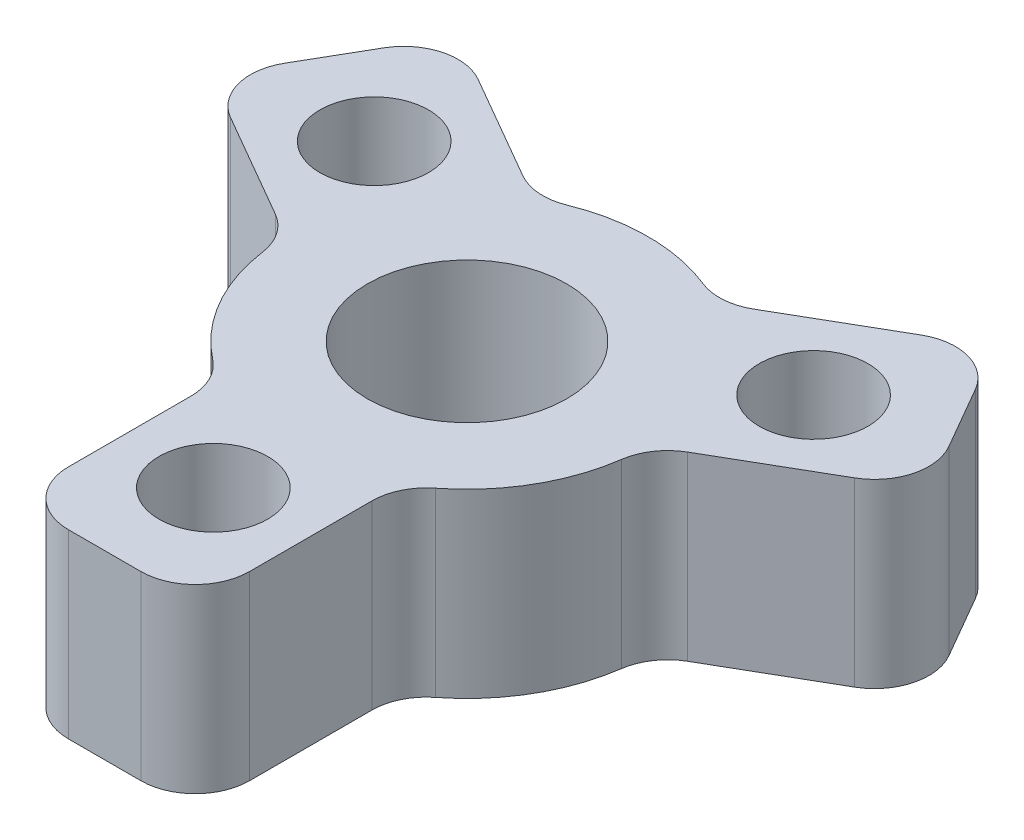
ISO-10303-21;
HEADER;
FILE_DESCRIPTION(('STEP AP214'),'2;1');
FILE_NAME('part.step','',(''),(''),'','','');
FILE_SCHEMA(('AUTOMOTIVE_DESIGN { 1 0 10303 214 1 1 1 1 }'));
ENDSEC;
DATA;
#1=APPLICATION_CONTEXT('core data for automotive mechanical design processes');
#2=APPLICATION_PROTOCOL_DEFINITION('international standard','automotive_design',2000,#1);
#3=PRODUCT_CONTEXT('',#1,'mechanical');
#4=PRODUCT('Part','Part','',(#3));
#5=PRODUCT_RELATED_PRODUCT_CATEGORY('part','',(#4));
#6=PRODUCT_DEFINITION_FORMATION('','',#4);
#7=PRODUCT_DEFINITION_CONTEXT('part definition',#1,'design');
#8=PRODUCT_DEFINITION('design','',#6,#7);
#9=PRODUCT_DEFINITION_SHAPE('','',#8);
#10=(LENGTH_UNIT() NAMED_UNIT(*) SI_UNIT(.MILLI.,.METRE.));
#11=(NAMED_UNIT(*) PLANE_ANGLE_UNIT() SI_UNIT($,.RADIAN.));
#12=(NAMED_UNIT(*) SI_UNIT($,.STERADIAN.) SOLID_ANGLE_UNIT());
#13=UNCERTAINTY_MEASURE_WITH_UNIT(LENGTH_MEASURE(1.E-05),#10,'distance_accuracy_value','');
#14=(GEOMETRIC_REPRESENTATION_CONTEXT(3) GLOBAL_UNCERTAINTY_ASSIGNED_CONTEXT((#13)) GLOBAL_UNIT_ASSIGNED_CONTEXT((#10,
#11,#12)) REPRESENTATION_CONTEXT('',''));
#15=CARTESIAN_POINT('',(0.,0.,0.));
#16=DIRECTION('',(0.,0.,1.));
#17=DIRECTION('',(1.,0.,0.));
#18=AXIS2_PLACEMENT_3D('',#15,#16,#17);
#19=CARTESIAN_POINT('',(0.,5.,0.));
#20=DIRECTION('',(0.,-1.,0.));
#21=DIRECTION('',(0.,0.,-1.));
#22=AXIS2_PLACEMENT_3D('',#19,#20,#21);
#23=CYLINDRICAL_SURFACE('',#22,5.);
#24=CARTESIAN_POINT('',(0.,0.,0.));
#25=DIRECTION('',(0.,1.,0.));
#26=DIRECTION('',(0.,0.,1.));
#27=AXIS2_PLACEMENT_3D('',#24,#25,#26);
#28=CIRCLE('',#27,5.);
#29=CARTESIAN_POINT('',(1.87466141332668,0.,-4.6352610050982));
#30=VERTEX_POINT('',#29);
#31=CARTESIAN_POINT('',(-1.87466141332675,0.,-4.63526100509818));
#32=VERTEX_POINT('',#31);
#33=EDGE_CURVE('E326',#30,#32,#28,.T.);
#34=ORIENTED_EDGE('',*,*,#33,.T.);
#35=DIRECTION('',(0.,-1.,0.));
#36=VECTOR('',#35,1.);
#37=CARTESIAN_POINT('',(-1.87466141332675,5.,-4.63526100509818));
#38=LINE('',#37,#36);
#39=CARTESIAN_POINT('',(-1.87466141332675,5.,-4.63526100509818));
#40=VERTEX_POINT('',#39);
#41=EDGE_CURVE('E315',#32,#40,#38,.F.);
#42=ORIENTED_EDGE('',*,*,#41,.T.);
#43=CARTESIAN_POINT('',(0.,5.,0.));
#44=DIRECTION('',(0.,1.,0.));
#45=DIRECTION('',(0.,0.,1.));
#46=AXIS2_PLACEMENT_3D('',#43,#44,#45);
#47=CIRCLE('',#46,5.);
#48=CARTESIAN_POINT('',(1.87466141332668,5.,-4.6352610050982));
#49=VERTEX_POINT('',#48);
#50=EDGE_CURVE('E343',#49,#40,#47,.T.);
#51=ORIENTED_EDGE('',*,*,#50,.F.);
#52=DIRECTION('',(0.,-1.,0.));
#53=VECTOR('',#52,1.);
#54=CARTESIAN_POINT('',(1.87466141332668,5.,-4.6352610050982));
#55=LINE('',#54,#53);
#56=EDGE_CURVE('E278',#49,#30,#55,.T.);
#57=ORIENTED_EDGE('',*,*,#56,.T.);
#58=EDGE_LOOP('',(#34,#42,#51,#57));
#59=FACE_BOUND('',#58,.T.);
#60=ADVANCED_FACE('F33',(#59),#23,.T.);
#61=CARTESIAN_POINT('',(3.07692307692308,0.,3.94113490998446));
#62=VERTEX_POINT('',#61);
#63=CARTESIAN_POINT('',(4.95158449024978,0.,0.694126095113712));
#64=VERTEX_POINT('',#63);
#65=EDGE_CURVE('E337',#62,#64,#28,.T.);
#66=ORIENTED_EDGE('',*,*,#65,.T.);
#67=DIRECTION('',(0.,-1.,0.));
#68=VECTOR('',#67,1.);
#69=CARTESIAN_POINT('',(4.95158449024978,5.,0.694126095113713));
#70=LINE('',#69,#68);
#71=CARTESIAN_POINT('',(4.95158449024978,5.,0.694126095113712));
#72=VERTEX_POINT('',#71);
#73=EDGE_CURVE('E280',#64,#72,#70,.F.);
#74=ORIENTED_EDGE('',*,*,#73,.T.);
#75=CARTESIAN_POINT('',(3.07692307692308,5.,3.94113490998446));
#76=VERTEX_POINT('',#75);
#77=EDGE_CURVE('E224',#76,#72,#47,.T.);
#78=ORIENTED_EDGE('',*,*,#77,.F.);
#79=DIRECTION('',(0.,-1.,0.));
#80=VECTOR('',#79,1.);
#81=CARTESIAN_POINT('',(3.07692307692308,5.,3.94113490998446));
#82=LINE('',#81,#80);
#83=EDGE_CURVE('E243',#76,#62,#82,.T.);
#84=ORIENTED_EDGE('',*,*,#83,.T.);
#85=EDGE_LOOP('',(#66,#74,#78,#84));
#86=FACE_BOUND('',#85,.T.);
#87=ADVANCED_FACE('F422',(#86),#23,.T.);
#88=CARTESIAN_POINT('',(-4.95158449024977,5.,0.69412609511378));
#89=VERTEX_POINT('',#88);
#90=CARTESIAN_POINT('',(-3.07692307692308,5.,3.94113490998446));
#91=VERTEX_POINT('',#90);
#92=EDGE_CURVE('E393',#89,#91,#47,.T.);
#93=ORIENTED_EDGE('',*,*,#92,.F.);
#94=DIRECTION('',(0.,-1.,0.));
#95=VECTOR('',#94,1.);
#96=CARTESIAN_POINT('',(-4.95158449024977,5.,0.69412609511378));
#97=LINE('',#96,#95);
#98=CARTESIAN_POINT('',(-4.95158449024977,0.,0.69412609511378));
#99=VERTEX_POINT('',#98);
#100=EDGE_CURVE('E313',#89,#99,#97,.T.);
#101=ORIENTED_EDGE('',*,*,#100,.T.);
#102=CARTESIAN_POINT('',(-3.07692307692308,0.,3.94113490998446));
#103=VERTEX_POINT('',#102);
#104=EDGE_CURVE('E338',#99,#103,#28,.T.);
#105=ORIENTED_EDGE('',*,*,#104,.T.);
#106=DIRECTION('',(0.,-1.,0.));
#107=VECTOR('',#106,1.);
#108=CARTESIAN_POINT('',(-3.07692307692308,5.,3.94113490998446));
#109=LINE('',#108,#107);
#110=EDGE_CURVE('E240',#103,#91,#109,.F.);
#111=ORIENTED_EDGE('',*,*,#110,.T.);
#112=EDGE_LOOP('',(#93,#101,#105,#111));
#113=FACE_BOUND('',#112,.T.);
#114=ADVANCED_FACE('F400',(#113),#23,.T.);
#115=CARTESIAN_POINT('',(0.,5.,0.));
#116=DIRECTION('',(0.,1.,0.));
#117=DIRECTION('',(0.,0.,1.));
#118=AXIS2_PLACEMENT_3D('',#115,#116,#117);
#119=PLANE('',#118);
#120=CARTESIAN_POINT('',(0.,5.,0.));
#121=DIRECTION('',(0.,1.,0.));
#122=DIRECTION('',(0.,0.,1.));
#123=AXIS2_PLACEMENT_3D('',#120,#121,#122);
#124=CIRCLE('',#123,2.75);
#125=CARTESIAN_POINT('',(0.,5.,2.75));
#126=VERTEX_POINT('',#125);
#127=EDGE_CURVE('E445',#126,#126,#124,.T.);
#128=ORIENTED_EDGE('',*,*,#127,.F.);
#129=EDGE_LOOP('',(#128));
#130=FACE_BOUND('',#129,.T.);
#131=CARTESIAN_POINT('',(6.06217782649105,5.,-3.50000000000003));
#132=DIRECTION('',(0.,1.,0.));
#133=DIRECTION('',(0.866025403784436,0.,-0.500000000000004));
#134=AXIS2_PLACEMENT_3D('',#131,#132,#133);
#135=CIRCLE('',#134,1.5);
#136=CARTESIAN_POINT('',(7.36121593216771,5.,-4.25000000000004));
#137=VERTEX_POINT('',#136);
#138=EDGE_CURVE('E449',#137,#137,#135,.T.);
#139=ORIENTED_EDGE('',*,*,#138,.F.);
#140=EDGE_LOOP('',(#139));
#141=FACE_BOUND('',#140,.T.);
#142=CARTESIAN_POINT('',(-6.0621778264911,5.,-3.49999999999994));
#143=DIRECTION('',(0.,1.,0.));
#144=DIRECTION('',(-0.866025403784443,0.,-0.499999999999992));
#145=AXIS2_PLACEMENT_3D('',#142,#143,#144);
#146=CIRCLE('',#145,1.5);
#147=CARTESIAN_POINT('',(-7.36121593216777,5.,-4.24999999999993));
#148=VERTEX_POINT('',#147);
#149=EDGE_CURVE('E452',#148,#148,#146,.T.);
#150=ORIENTED_EDGE('',*,*,#149,.F.);
#151=EDGE_LOOP('',(#150));
#152=FACE_BOUND('',#151,.T.);
#153=DIRECTION('',(-0.866025403784443,0.,-0.499999999999992));
#154=VECTOR('',#153,1.);
#155=CARTESIAN_POINT('',(-7.41025403784445,5.,-7.16506350946103));
#156=LINE('',#155,#154);
#157=CARTESIAN_POINT('',(-3.18705983732476,5.,-4.72680120095097));
#158=VERTEX_POINT('',#157);
#159=CARTESIAN_POINT('',(-6.11121593216779,5.,-6.41506350946104));
#160=VERTEX_POINT('',#159);
#161=EDGE_CURVE('E341',#158,#160,#156,.T.);
#162=ORIENTED_EDGE('',*,*,#161,.T.);
#163=CARTESIAN_POINT('',(-6.86121593216778,5.,-5.11602540378438));
#164=DIRECTION('',(0.,1.,0.));
#165=DIRECTION('',(0.,0.,1.));
#166=AXIS2_PLACEMENT_3D('',#163,#164,#165);
#167=CIRCLE('',#166,1.5);
#168=CARTESIAN_POINT('',(-8.16025403784444,5.,-5.86602540378436));
#169=VERTEX_POINT('',#168);
#170=EDGE_CURVE('E306',#160,#169,#167,.T.);
#171=ORIENTED_EDGE('',*,*,#170,.T.);
#172=DIRECTION('',(-0.499999999999992,0.,0.866025403784443));
#173=VECTOR('',#172,1.);
#174=CARTESIAN_POINT('',(-7.41025403784445,5.,-7.16506350946103));
#175=LINE('',#174,#173);
#176=CARTESIAN_POINT('',(-9.16025403784442,5.,-4.13397459621547));
#177=VERTEX_POINT('',#176);
#178=EDGE_CURVE('E353',#169,#177,#175,.T.);
#179=ORIENTED_EDGE('',*,*,#178,.T.);
#180=CARTESIAN_POINT('',(-7.86121593216776,5.,-3.38397459621549));
#181=DIRECTION('',(0.,1.,0.));
#182=DIRECTION('',(0.,0.,1.));
#183=AXIS2_PLACEMENT_3D('',#180,#181,#182);
#184=CIRCLE('',#183,1.5);
#185=CARTESIAN_POINT('',(-8.61121593216775,5.,-2.08493649053882));
#186=VERTEX_POINT('',#185);
#187=EDGE_CURVE('E304',#177,#186,#184,.T.);
#188=ORIENTED_EDGE('',*,*,#187,.T.);
#189=DIRECTION('',(0.866025403784443,0.,0.499999999999992));
#190=VECTOR('',#189,1.);
#191=CARTESIAN_POINT('',(-9.91025403784441,5.,-2.83493649053881));
#192=LINE('',#191,#190);
#193=CARTESIAN_POINT('',(-5.68705983732471,5.,-0.39667418202875));
#194=VERTEX_POINT('',#193);
#195=EDGE_CURVE('E348',#186,#194,#192,.T.);
#196=ORIENTED_EDGE('',*,*,#195,.T.);
#197=CARTESIAN_POINT('',(-6.4370598373247,5.,0.902363923647914));
#198=DIRECTION('',(0.,1.,0.));
#199=DIRECTION('',(0.,0.,1.));
#200=AXIS2_PLACEMENT_3D('',#197,#198,#199);
#201=CIRCLE('',#200,1.5);
#202=EDGE_CURVE('E48',#194,#89,#201,.F.);
#203=ORIENTED_EDGE('',*,*,#202,.T.);
#204=ORIENTED_EDGE('',*,*,#92,.T.);
#205=CARTESIAN_POINT('',(-4.,5.,5.1234753829798));
#206=DIRECTION('',(0.,1.,0.));
#207=DIRECTION('',(0.,0.,1.));
#208=AXIS2_PLACEMENT_3D('',#205,#206,#207);
#209=CIRCLE('',#208,1.5);
#210=CARTESIAN_POINT('',(-2.5,5.,5.1234753829798));
#211=VERTEX_POINT('',#210);
#212=EDGE_CURVE('E252',#91,#211,#209,.F.);
#213=ORIENTED_EDGE('',*,*,#212,.T.);
#214=DIRECTION('',(0.,0.,1.));
#215=VECTOR('',#214,1.);
#216=CARTESIAN_POINT('',(-2.5,5.,10.));
#217=LINE('',#216,#215);
#218=CARTESIAN_POINT('',(-2.5,5.,8.5));
#219=VERTEX_POINT('',#218);
#220=EDGE_CURVE('E201',#211,#219,#217,.T.);
#221=ORIENTED_EDGE('',*,*,#220,.T.);
#222=CARTESIAN_POINT('',(-1.,5.,8.5));
#223=DIRECTION('',(0.,1.,0.));
#224=DIRECTION('',(0.,0.,1.));
#225=AXIS2_PLACEMENT_3D('',#222,#223,#224);
#226=CIRCLE('',#225,1.5);
#227=CARTESIAN_POINT('',(-1.,5.,10.));
#228=VERTEX_POINT('',#227);
#229=EDGE_CURVE('E193',#219,#228,#226,.T.);
#230=ORIENTED_EDGE('',*,*,#229,.T.);
#231=DIRECTION('',(1.,0.,0.));
#232=VECTOR('',#231,1.);
#233=CARTESIAN_POINT('',(-2.5,5.,10.));
#234=LINE('',#233,#232);
#235=CARTESIAN_POINT('',(1.,5.,10.));
#236=VERTEX_POINT('',#235);
#237=EDGE_CURVE('E198',#228,#236,#234,.T.);
#238=ORIENTED_EDGE('',*,*,#237,.T.);
#239=CARTESIAN_POINT('',(1.,5.,8.5));
#240=DIRECTION('',(0.,1.,0.));
#241=DIRECTION('',(0.,0.,1.));
#242=AXIS2_PLACEMENT_3D('',#239,#240,#241);
#243=CIRCLE('',#242,1.5);
#244=CARTESIAN_POINT('',(2.5,5.,8.5));
#245=VERTEX_POINT('',#244);
#246=EDGE_CURVE('E206',#236,#245,#243,.T.);
#247=ORIENTED_EDGE('',*,*,#246,.T.);
#248=DIRECTION('',(0.,0.,-1.));
#249=VECTOR('',#248,1.);
#250=CARTESIAN_POINT('',(2.5,5.,10.));
#251=LINE('',#250,#249);
#252=CARTESIAN_POINT('',(2.5,5.,5.1234753829798));
#253=VERTEX_POINT('',#252);
#254=EDGE_CURVE('E216',#245,#253,#251,.T.);
#255=ORIENTED_EDGE('',*,*,#254,.T.);
#256=CARTESIAN_POINT('',(4.,5.,5.1234753829798));
#257=DIRECTION('',(0.,1.,0.));
#258=DIRECTION('',(0.,0.,1.));
#259=AXIS2_PLACEMENT_3D('',#256,#257,#258);
#260=CIRCLE('',#259,1.5);
#261=EDGE_CURVE('E245',#253,#76,#260,.F.);
#262=ORIENTED_EDGE('',*,*,#261,.T.);
#263=ORIENTED_EDGE('',*,*,#77,.T.);
#264=CARTESIAN_POINT('',(6.43705983732472,5.,0.902363923647826));
#265=DIRECTION('',(0.,1.,0.));
#266=DIRECTION('',(0.,0.,1.));
#267=AXIS2_PLACEMENT_3D('',#264,#265,#266);
#268=CIRCLE('',#267,1.5);
#269=CARTESIAN_POINT('',(5.68705983732471,5.,-0.396674182028828));
#270=VERTEX_POINT('',#269);
#271=EDGE_CURVE('E288',#72,#270,#268,.F.);
#272=ORIENTED_EDGE('',*,*,#271,.T.);
#273=DIRECTION('',(0.866025403784436,0.,-0.500000000000004));
#274=VECTOR('',#273,1.);
#275=CARTESIAN_POINT('',(9.91025403784437,5.,-2.83493649053895));
#276=LINE('',#275,#274);
#277=CARTESIAN_POINT('',(8.61121593216772,5.,-2.08493649053894));
#278=VERTEX_POINT('',#277);
#279=EDGE_CURVE('E368',#270,#278,#276,.T.);
#280=ORIENTED_EDGE('',*,*,#279,.T.);
#281=CARTESIAN_POINT('',(7.86121593216771,5.,-3.3839745962156));
#282=DIRECTION('',(0.,1.,0.));
#283=DIRECTION('',(0.,0.,1.));
#284=AXIS2_PLACEMENT_3D('',#281,#282,#283);
#285=CIRCLE('',#284,1.5);
#286=CARTESIAN_POINT('',(9.16025403784437,5.,-4.1339745962156));
#287=VERTEX_POINT('',#286);
#288=EDGE_CURVE('E270',#278,#287,#285,.T.);
#289=ORIENTED_EDGE('',*,*,#288,.T.);
#290=DIRECTION('',(-0.500000000000004,0.,-0.866025403784436));
#291=VECTOR('',#290,1.);
#292=CARTESIAN_POINT('',(9.91025403784437,5.,-2.83493649053895));
#293=LINE('',#292,#291);
#294=CARTESIAN_POINT('',(8.16025403784436,5.,-5.86602540378448));
#295=VERTEX_POINT('',#294);
#296=EDGE_CURVE('E365',#287,#295,#293,.T.);
#297=ORIENTED_EDGE('',*,*,#296,.T.);
#298=CARTESIAN_POINT('',(6.86121593216771,5.,-5.11602540378447));
#299=DIRECTION('',(0.,1.,0.));
#300=DIRECTION('',(0.,0.,1.));
#301=AXIS2_PLACEMENT_3D('',#298,#299,#300);
#302=CIRCLE('',#301,1.5);
#303=CARTESIAN_POINT('',(6.1112159321677,5.,-6.41506350946112));
#304=VERTEX_POINT('',#303);
#305=EDGE_CURVE('E268',#295,#304,#302,.T.);
#306=ORIENTED_EDGE('',*,*,#305,.T.);
#307=DIRECTION('',(-0.866025403784436,0.,0.500000000000004));
#308=VECTOR('',#307,1.);
#309=CARTESIAN_POINT('',(7.41025403784436,5.,-7.16506350946113));
#310=LINE('',#309,#308);
#311=CARTESIAN_POINT('',(3.18705983732469,5.,-4.72680120095101));
#312=VERTEX_POINT('',#311);
#313=EDGE_CURVE('E372',#304,#312,#310,.T.);
#314=ORIENTED_EDGE('',*,*,#313,.T.);
#315=CARTESIAN_POINT('',(2.43705983732469,5.,-6.02583930662767));
#316=DIRECTION('',(0.,1.,0.));
#317=DIRECTION('',(0.,0.,1.));
#318=AXIS2_PLACEMENT_3D('',#315,#316,#317);
#319=CIRCLE('',#318,1.5);
#320=EDGE_CURVE('E282',#312,#49,#319,.F.);
#321=ORIENTED_EDGE('',*,*,#320,.T.);
#322=ORIENTED_EDGE('',*,*,#50,.T.);
#323=CARTESIAN_POINT('',(-2.43705983732477,5.,-6.02583930662763));
#324=DIRECTION('',(0.,1.,0.));
#325=DIRECTION('',(0.,0.,1.));
#326=AXIS2_PLACEMENT_3D('',#323,#324,#325);
#327=CIRCLE('',#326,1.5);
#328=EDGE_CURVE('E11',#40,#158,#327,.F.);
#329=ORIENTED_EDGE('',*,*,#328,.T.);
#330=EDGE_LOOP('',(#162,#171,#179,#188,#196,#203,#204,#213,#221,#230,#238,#247,#255,#262,#263,
#272,#280,#289,#297,#306,#314,#321,#322,#329));
#331=FACE_BOUND('',#330,.T.);
#332=CARTESIAN_POINT('',(0.,5.,7.));
#333=DIRECTION('',(0.,1.,0.));
#334=DIRECTION('',(0.,0.,1.));
#335=AXIS2_PLACEMENT_3D('',#332,#333,#334);
#336=CIRCLE('',#335,1.5);
#337=CARTESIAN_POINT('',(0.,5.,8.5));
#338=VERTEX_POINT('',#337);
#339=EDGE_CURVE('E371',#338,#338,#336,.T.);
#340=ORIENTED_EDGE('',*,*,#339,.F.);
#341=EDGE_LOOP('',(#340));
#342=FACE_BOUND('',#341,.T.);
#343=ADVANCED_FACE('F196',(#130,#141,#152,#331,#342),#119,.T.);
#344=CARTESIAN_POINT('',(0.,0.,0.));
#345=DIRECTION('',(0.,1.,0.));
#346=DIRECTION('',(0.,0.,1.));
#347=AXIS2_PLACEMENT_3D('',#344,#345,#346);
#348=PLANE('',#347);
#349=CARTESIAN_POINT('',(0.,0.,0.));
#350=DIRECTION('',(0.,1.,0.));
#351=DIRECTION('',(0.,0.,1.));
#352=AXIS2_PLACEMENT_3D('',#349,#350,#351);
#353=CIRCLE('',#352,2.75);
#354=CARTESIAN_POINT('',(0.,0.,2.75));
#355=VERTEX_POINT('',#354);
#356=EDGE_CURVE('E455',#355,#355,#353,.T.);
#357=ORIENTED_EDGE('',*,*,#356,.T.);
#358=EDGE_LOOP('',(#357));
#359=FACE_BOUND('',#358,.T.);
#360=CARTESIAN_POINT('',(6.06217782649105,0.,-3.50000000000003));
#361=DIRECTION('',(0.,1.,0.));
#362=DIRECTION('',(0.866025403784436,0.,-0.500000000000004));
#363=AXIS2_PLACEMENT_3D('',#360,#361,#362);
#364=CIRCLE('',#363,1.5);
#365=CARTESIAN_POINT('',(7.36121593216771,0.,-4.25000000000004));
#366=VERTEX_POINT('',#365);
#367=EDGE_CURVE('E465',#366,#366,#364,.T.);
#368=ORIENTED_EDGE('',*,*,#367,.T.);
#369=EDGE_LOOP('',(#368));
#370=FACE_BOUND('',#369,.T.);
#371=CARTESIAN_POINT('',(-6.0621778264911,0.,-3.49999999999994));
#372=DIRECTION('',(0.,1.,0.));
#373=DIRECTION('',(-0.866025403784443,0.,-0.499999999999992));
#374=AXIS2_PLACEMENT_3D('',#371,#372,#373);
#375=CIRCLE('',#374,1.5);
#376=CARTESIAN_POINT('',(-7.36121593216777,0.,-4.24999999999993));
#377=VERTEX_POINT('',#376);
#378=EDGE_CURVE('E454',#377,#377,#375,.T.);
#379=ORIENTED_EDGE('',*,*,#378,.T.);
#380=EDGE_LOOP('',(#379));
#381=FACE_BOUND('',#380,.T.);
#382=DIRECTION('',(-0.499999999999992,0.,0.866025403784443));
#383=VECTOR('',#382,1.);
#384=CARTESIAN_POINT('',(-7.41025403784445,0.,-7.16506350946103));
#385=LINE('',#384,#383);
#386=CARTESIAN_POINT('',(-8.16025403784444,0.,-5.86602540378436));
#387=VERTEX_POINT('',#386);
#388=CARTESIAN_POINT('',(-9.16025403784442,0.,-4.13397459621548));
#389=VERTEX_POINT('',#388);
#390=EDGE_CURVE('E361',#387,#389,#385,.T.);
#391=ORIENTED_EDGE('',*,*,#390,.F.);
#392=CARTESIAN_POINT('',(-6.86121593216778,0.,-5.11602540378438));
#393=DIRECTION('',(0.,1.,0.));
#394=DIRECTION('',(0.,0.,1.));
#395=AXIS2_PLACEMENT_3D('',#392,#393,#394);
#396=CIRCLE('',#395,1.5);
#397=CARTESIAN_POINT('',(-6.11121593216779,0.,-6.41506350946104));
#398=VERTEX_POINT('',#397);
#399=EDGE_CURVE('E297',#387,#398,#396,.F.);
#400=ORIENTED_EDGE('',*,*,#399,.T.);
#401=DIRECTION('',(-0.866025403784443,0.,-0.499999999999992));
#402=VECTOR('',#401,1.);
#403=CARTESIAN_POINT('',(-7.41025403784445,0.,-7.16506350946103));
#404=LINE('',#403,#402);
#405=CARTESIAN_POINT('',(-3.18705983732476,0.,-4.72680120095097));
#406=VERTEX_POINT('',#405);
#407=EDGE_CURVE('E329',#406,#398,#404,.T.);
#408=ORIENTED_EDGE('',*,*,#407,.F.);
#409=CARTESIAN_POINT('',(-2.43705983732477,0.,-6.02583930662763));
#410=DIRECTION('',(0.,1.,0.));
#411=DIRECTION('',(0.,0.,1.));
#412=AXIS2_PLACEMENT_3D('',#409,#410,#411);
#413=CIRCLE('',#412,1.5);
#414=EDGE_CURVE('E41',#406,#32,#413,.T.);
#415=ORIENTED_EDGE('',*,*,#414,.T.);
#416=ORIENTED_EDGE('',*,*,#33,.F.);
#417=CARTESIAN_POINT('',(2.43705983732469,0.,-6.02583930662767));
#418=DIRECTION('',(0.,1.,0.));
#419=DIRECTION('',(0.,0.,1.));
#420=AXIS2_PLACEMENT_3D('',#417,#418,#419);
#421=CIRCLE('',#420,1.5);
#422=CARTESIAN_POINT('',(3.18705983732469,0.,-4.72680120095101));
#423=VERTEX_POINT('',#422);
#424=EDGE_CURVE('E284',#30,#423,#421,.T.);
#425=ORIENTED_EDGE('',*,*,#424,.T.);
#426=DIRECTION('',(-0.866025403784436,0.,0.500000000000004));
#427=VECTOR('',#426,1.);
#428=CARTESIAN_POINT('',(7.41025403784436,0.,-7.16506350946113));
#429=LINE('',#428,#427);
#430=CARTESIAN_POINT('',(6.1112159321677,0.,-6.41506350946112));
#431=VERTEX_POINT('',#430);
#432=EDGE_CURVE('E347',#431,#423,#429,.T.);
#433=ORIENTED_EDGE('',*,*,#432,.F.);
#434=CARTESIAN_POINT('',(6.86121593216771,0.,-5.11602540378447));
#435=DIRECTION('',(0.,1.,0.));
#436=DIRECTION('',(0.,0.,1.));
#437=AXIS2_PLACEMENT_3D('',#434,#435,#436);
#438=CIRCLE('',#437,1.5);
#439=CARTESIAN_POINT('',(8.16025403784436,0.,-5.86602540378448));
#440=VERTEX_POINT('',#439);
#441=EDGE_CURVE('E259',#431,#440,#438,.F.);
#442=ORIENTED_EDGE('',*,*,#441,.T.);
#443=DIRECTION('',(-0.500000000000004,0.,-0.866025403784436));
#444=VECTOR('',#443,1.);
#445=CARTESIAN_POINT('',(9.91025403784437,0.,-2.83493649053895));
#446=LINE('',#445,#444);
#447=CARTESIAN_POINT('',(9.16025403784437,0.,-4.1339745962156));
#448=VERTEX_POINT('',#447);
#449=EDGE_CURVE('E362',#448,#440,#446,.T.);
#450=ORIENTED_EDGE('',*,*,#449,.F.);
#451=CARTESIAN_POINT('',(7.86121593216771,0.,-3.3839745962156));
#452=DIRECTION('',(0.,1.,0.));
#453=DIRECTION('',(0.,0.,1.));
#454=AXIS2_PLACEMENT_3D('',#451,#452,#453);
#455=CIRCLE('',#454,1.5);
#456=CARTESIAN_POINT('',(8.61121593216772,0.,-2.08493649053894));
#457=VERTEX_POINT('',#456);
#458=EDGE_CURVE('E261',#448,#457,#455,.F.);
#459=ORIENTED_EDGE('',*,*,#458,.T.);
#460=DIRECTION('',(0.866025403784436,0.,-0.500000000000004));
#461=VECTOR('',#460,1.);
#462=CARTESIAN_POINT('',(9.91025403784437,0.,-2.83493649053895));
#463=LINE('',#462,#461);
#464=CARTESIAN_POINT('',(5.68705983732471,0.,-0.396674182028827));
#465=VERTEX_POINT('',#464);
#466=EDGE_CURVE('E351',#465,#457,#463,.T.);
#467=ORIENTED_EDGE('',*,*,#466,.F.);
#468=CARTESIAN_POINT('',(6.43705983732472,0.,0.902363923647826));
#469=DIRECTION('',(0.,1.,0.));
#470=DIRECTION('',(0.,0.,1.));
#471=AXIS2_PLACEMENT_3D('',#468,#469,#470);
#472=CIRCLE('',#471,1.5);
#473=EDGE_CURVE('E286',#465,#64,#472,.T.);
#474=ORIENTED_EDGE('',*,*,#473,.T.);
#475=ORIENTED_EDGE('',*,*,#65,.F.);
#476=CARTESIAN_POINT('',(4.,0.,5.1234753829798));
#477=DIRECTION('',(0.,1.,0.));
#478=DIRECTION('',(0.,0.,1.));
#479=AXIS2_PLACEMENT_3D('',#476,#477,#478);
#480=CIRCLE('',#479,1.5);
#481=CARTESIAN_POINT('',(2.5,0.,5.1234753829798));
#482=VERTEX_POINT('',#481);
#483=EDGE_CURVE('E247',#62,#482,#480,.T.);
#484=ORIENTED_EDGE('',*,*,#483,.T.);
#485=DIRECTION('',(0.,0.,-1.));
#486=VECTOR('',#485,1.);
#487=CARTESIAN_POINT('',(2.5,0.,10.));
#488=LINE('',#487,#486);
#489=CARTESIAN_POINT('',(2.5,0.,8.5));
#490=VERTEX_POINT('',#489);
#491=EDGE_CURVE('E380',#490,#482,#488,.T.);
#492=ORIENTED_EDGE('',*,*,#491,.F.);
#493=CARTESIAN_POINT('',(1.,0.,8.5));
#494=DIRECTION('',(0.,1.,0.));
#495=DIRECTION('',(0.,0.,1.));
#496=AXIS2_PLACEMENT_3D('',#493,#494,#495);
#497=CIRCLE('',#496,1.5);
#498=CARTESIAN_POINT('',(1.,0.,10.));
#499=VERTEX_POINT('',#498);
#500=EDGE_CURVE('E221',#490,#499,#497,.F.);
#501=ORIENTED_EDGE('',*,*,#500,.T.);
#502=DIRECTION('',(1.,0.,0.));
#503=VECTOR('',#502,1.);
#504=CARTESIAN_POINT('',(-2.5,0.,10.));
#505=LINE('',#504,#503);
#506=CARTESIAN_POINT('',(-1.,0.,10.));
#507=VERTEX_POINT('',#506);
#508=EDGE_CURVE('E217',#507,#499,#505,.T.);
#509=ORIENTED_EDGE('',*,*,#508,.F.);
#510=CARTESIAN_POINT('',(-1.,0.,8.5));
#511=DIRECTION('',(0.,1.,0.));
#512=DIRECTION('',(0.,0.,1.));
#513=AXIS2_PLACEMENT_3D('',#510,#511,#512);
#514=CIRCLE('',#513,1.5);
#515=CARTESIAN_POINT('',(-2.5,0.,8.5));
#516=VERTEX_POINT('',#515);
#517=EDGE_CURVE('E220',#507,#516,#514,.F.);
#518=ORIENTED_EDGE('',*,*,#517,.T.);
#519=DIRECTION('',(0.,0.,1.));
#520=VECTOR('',#519,1.);
#521=CARTESIAN_POINT('',(-2.5,0.,10.));
#522=LINE('',#521,#520);
#523=CARTESIAN_POINT('',(-2.5,0.,5.1234753829798));
#524=VERTEX_POINT('',#523);
#525=EDGE_CURVE('E384',#524,#516,#522,.T.);
#526=ORIENTED_EDGE('',*,*,#525,.F.);
#527=CARTESIAN_POINT('',(-4.,0.,5.1234753829798));
#528=DIRECTION('',(0.,1.,0.));
#529=DIRECTION('',(0.,0.,1.));
#530=AXIS2_PLACEMENT_3D('',#527,#528,#529);
#531=CIRCLE('',#530,1.5);
#532=EDGE_CURVE('E249',#524,#103,#531,.T.);
#533=ORIENTED_EDGE('',*,*,#532,.T.);
#534=ORIENTED_EDGE('',*,*,#104,.F.);
#535=CARTESIAN_POINT('',(-6.4370598373247,0.,0.902363923647914));
#536=DIRECTION('',(0.,1.,0.));
#537=DIRECTION('',(0.,0.,1.));
#538=AXIS2_PLACEMENT_3D('',#535,#536,#537);
#539=CIRCLE('',#538,1.5);
#540=CARTESIAN_POINT('',(-5.68705983732472,0.,-0.396674182028751));
#541=VERTEX_POINT('',#540);
#542=EDGE_CURVE('E318',#99,#541,#539,.T.);
#543=ORIENTED_EDGE('',*,*,#542,.T.);
#544=DIRECTION('',(0.866025403784443,0.,0.499999999999992));
#545=VECTOR('',#544,1.);
#546=CARTESIAN_POINT('',(-9.91025403784441,0.,-2.83493649053881));
#547=LINE('',#546,#545);
#548=CARTESIAN_POINT('',(-8.61121593216775,0.,-2.08493649053882));
#549=VERTEX_POINT('',#548);
#550=EDGE_CURVE('E356',#549,#541,#547,.T.);
#551=ORIENTED_EDGE('',*,*,#550,.F.);
#552=CARTESIAN_POINT('',(-7.86121593216776,0.,-3.38397459621549));
#553=DIRECTION('',(0.,1.,0.));
#554=DIRECTION('',(0.,0.,1.));
#555=AXIS2_PLACEMENT_3D('',#552,#553,#554);
#556=CIRCLE('',#555,1.5);
#557=EDGE_CURVE('E295',#549,#389,#556,.F.);
#558=ORIENTED_EDGE('',*,*,#557,.T.);
#559=EDGE_LOOP('',(#391,#400,#408,#415,#416,#425,#433,#442,#450,#459,#467,#474,#475,#484,#492,
#501,#509,#518,#526,#533,#534,#543,#551,#558));
#560=FACE_BOUND('',#559,.T.);
#561=CARTESIAN_POINT('',(0.,0.,7.));
#562=DIRECTION('',(0.,1.,0.));
#563=DIRECTION('',(0.,0.,1.));
#564=AXIS2_PLACEMENT_3D('',#561,#562,#563);
#565=CIRCLE('',#564,1.5);
#566=CARTESIAN_POINT('',(0.,0.,8.5));
#567=VERTEX_POINT('',#566);
#568=EDGE_CURVE('E377',#567,#567,#565,.T.);
#569=ORIENTED_EDGE('',*,*,#568,.T.);
#570=EDGE_LOOP('',(#569));
#571=FACE_BOUND('',#570,.T.);
#572=ADVANCED_FACE('F324',(#359,#370,#381,#560,#571),#348,.F.);
#573=CARTESIAN_POINT('',(2.5,16.180339887499,10.));
#574=DIRECTION('',(-1.,0.,0.));
#575=DIRECTION('',(0.,0.,1.));
#576=AXIS2_PLACEMENT_3D('',#573,#574,#575);
#577=PLANE('',#576);
#578=ORIENTED_EDGE('',*,*,#254,.F.);
#579=DIRECTION('',(0.,-1.,0.));
#580=VECTOR('',#579,1.);
#581=CARTESIAN_POINT('',(2.5,16.180339887499,8.5));
#582=LINE('',#581,#580);
#583=EDGE_CURVE('E237',#245,#490,#582,.T.);
#584=ORIENTED_EDGE('',*,*,#583,.T.);
#585=ORIENTED_EDGE('',*,*,#491,.T.);
#586=DIRECTION('',(0.,1.,0.));
#587=VECTOR('',#586,1.);
#588=CARTESIAN_POINT('',(2.5,5.,5.1234753829798));
#589=LINE('',#588,#587);
#590=EDGE_CURVE('E205',#482,#253,#589,.T.);
#591=ORIENTED_EDGE('',*,*,#590,.T.);
#592=EDGE_LOOP('',(#578,#584,#585,#591));
#593=FACE_BOUND('',#592,.T.);
#594=ADVANCED_FACE('F411',(#593),#577,.F.);
#595=CARTESIAN_POINT('',(-2.5,16.180339887499,10.));
#596=DIRECTION('',(1.,0.,0.));
#597=DIRECTION('',(0.,0.,-1.));
#598=AXIS2_PLACEMENT_3D('',#595,#596,#597);
#599=PLANE('',#598);
#600=ORIENTED_EDGE('',*,*,#525,.T.);
#601=DIRECTION('',(0.,-1.,0.));
#602=VECTOR('',#601,1.);
#603=CARTESIAN_POINT('',(-2.5,16.180339887499,8.5));
#604=LINE('',#603,#602);
#605=EDGE_CURVE('E232',#516,#219,#604,.F.);
#606=ORIENTED_EDGE('',*,*,#605,.T.);
#607=ORIENTED_EDGE('',*,*,#220,.F.);
#608=DIRECTION('',(0.,1.,0.));
#609=VECTOR('',#608,1.);
#610=CARTESIAN_POINT('',(-2.5,0.,5.1234753829798));
#611=LINE('',#610,#609);
#612=EDGE_CURVE('E229',#211,#524,#611,.F.);
#613=ORIENTED_EDGE('',*,*,#612,.T.);
#614=EDGE_LOOP('',(#600,#606,#607,#613));
#615=FACE_BOUND('',#614,.T.);
#616=ADVANCED_FACE('F409',(#615),#599,.F.);
#617=CARTESIAN_POINT('',(-2.5,16.180339887499,10.));
#618=DIRECTION('',(0.,0.,-1.));
#619=DIRECTION('',(-1.,0.,0.));
#620=AXIS2_PLACEMENT_3D('',#617,#618,#619);
#621=PLANE('',#620);
#622=ORIENTED_EDGE('',*,*,#237,.F.);
#623=DIRECTION('',(0.,-1.,0.));
#624=VECTOR('',#623,1.);
#625=CARTESIAN_POINT('',(-1.,16.180339887499,10.));
#626=LINE('',#625,#624);
#627=EDGE_CURVE('E212',#228,#507,#626,.T.);
#628=ORIENTED_EDGE('',*,*,#627,.T.);
#629=ORIENTED_EDGE('',*,*,#508,.T.);
#630=DIRECTION('',(0.,-1.,0.));
#631=VECTOR('',#630,1.);
#632=CARTESIAN_POINT('',(1.,16.180339887499,10.));
#633=LINE('',#632,#631);
#634=EDGE_CURVE('E215',#499,#236,#633,.F.);
#635=ORIENTED_EDGE('',*,*,#634,.T.);
#636=EDGE_LOOP('',(#622,#628,#629,#635));
#637=FACE_BOUND('',#636,.T.);
#638=ADVANCED_FACE('F210',(#637),#621,.F.);
#639=CARTESIAN_POINT('',(0.,0.,7.));
#640=DIRECTION('',(0.,1.,0.));
#641=DIRECTION('',(0.,0.,1.));
#642=AXIS2_PLACEMENT_3D('',#639,#640,#641);
#643=CYLINDRICAL_SURFACE('',#642,1.5);
#644=ORIENTED_EDGE('',*,*,#568,.F.);
#645=EDGE_LOOP('',(#644));
#646=FACE_BOUND('',#645,.T.);
#647=ORIENTED_EDGE('',*,*,#339,.T.);
#648=EDGE_LOOP('',(#647));
#649=FACE_BOUND('',#648,.T.);
#650=ADVANCED_FACE('F417',(#646,#649),#643,.F.);
#651=CARTESIAN_POINT('',(-1.,16.180339887499,8.5));
#652=DIRECTION('',(0.,-1.,0.));
#653=DIRECTION('',(0.,0.,-1.));
#654=AXIS2_PLACEMENT_3D('',#651,#652,#653);
#655=CYLINDRICAL_SURFACE('',#654,1.5);
#656=ORIENTED_EDGE('',*,*,#229,.F.);
#657=ORIENTED_EDGE('',*,*,#605,.F.);
#658=ORIENTED_EDGE('',*,*,#517,.F.);
#659=ORIENTED_EDGE('',*,*,#627,.F.);
#660=EDGE_LOOP('',(#656,#657,#658,#659));
#661=FACE_BOUND('',#660,.T.);
#662=ADVANCED_FACE('F219',(#661),#655,.T.);
#663=CARTESIAN_POINT('',(1.,16.180339887499,8.5));
#664=DIRECTION('',(0.,-1.,0.));
#665=DIRECTION('',(0.,0.,-1.));
#666=AXIS2_PLACEMENT_3D('',#663,#664,#665);
#667=CYLINDRICAL_SURFACE('',#666,1.5);
#668=ORIENTED_EDGE('',*,*,#246,.F.);
#669=ORIENTED_EDGE('',*,*,#634,.F.);
#670=ORIENTED_EDGE('',*,*,#500,.F.);
#671=ORIENTED_EDGE('',*,*,#583,.F.);
#672=EDGE_LOOP('',(#668,#669,#670,#671));
#673=FACE_BOUND('',#672,.T.);
#674=ADVANCED_FACE('F521',(#673),#667,.T.);
#675=CARTESIAN_POINT('',(4.,5.,5.1234753829798));
#676=DIRECTION('',(0.,-1.,0.));
#677=DIRECTION('',(0.,0.,-1.));
#678=AXIS2_PLACEMENT_3D('',#675,#676,#677);
#679=CYLINDRICAL_SURFACE('',#678,1.5);
#680=ORIENTED_EDGE('',*,*,#483,.F.);
#681=ORIENTED_EDGE('',*,*,#83,.F.);
#682=ORIENTED_EDGE('',*,*,#261,.F.);
#683=ORIENTED_EDGE('',*,*,#590,.F.);
#684=EDGE_LOOP('',(#680,#681,#682,#683));
#685=FACE_BOUND('',#684,.T.);
#686=ADVANCED_FACE('F529',(#685),#679,.F.);
#687=CARTESIAN_POINT('',(-4.,5.,5.1234753829798));
#688=DIRECTION('',(0.,-1.,0.));
#689=DIRECTION('',(0.,0.,-1.));
#690=AXIS2_PLACEMENT_3D('',#687,#688,#689);
#691=CYLINDRICAL_SURFACE('',#690,1.5);
#692=ORIENTED_EDGE('',*,*,#212,.F.);
#693=ORIENTED_EDGE('',*,*,#110,.F.);
#694=ORIENTED_EDGE('',*,*,#532,.F.);
#695=ORIENTED_EDGE('',*,*,#612,.F.);
#696=EDGE_LOOP('',(#692,#693,#694,#695));
#697=FACE_BOUND('',#696,.T.);
#698=ADVANCED_FACE('F407',(#697),#691,.F.);
#699=CARTESIAN_POINT('',(-7.41025403784445,19.546564555882,-7.16506350946103));
#700=DIRECTION('',(0.866025403784443,0.,0.499999999999992));
#701=DIRECTION('',(0.499999999999992,0.,-0.866025403784443));
#702=AXIS2_PLACEMENT_3D('',#699,#700,#701);
#703=PLANE('',#702);
#704=ORIENTED_EDGE('',*,*,#178,.F.);
#705=DIRECTION('',(0.,-1.,0.));
#706=VECTOR('',#705,1.);
#707=CARTESIAN_POINT('',(-8.16025403784444,19.546564555882,-5.86602540378436));
#708=LINE('',#707,#706);
#709=EDGE_CURVE('E292',#169,#387,#708,.T.);
#710=ORIENTED_EDGE('',*,*,#709,.T.);
#711=ORIENTED_EDGE('',*,*,#390,.T.);
#712=DIRECTION('',(0.,-1.,0.));
#713=VECTOR('',#712,1.);
#714=CARTESIAN_POINT('',(-9.16025403784442,19.546564555882,-4.13397459621548));
#715=LINE('',#714,#713);
#716=EDGE_CURVE('E290',#389,#177,#715,.F.);
#717=ORIENTED_EDGE('',*,*,#716,.T.);
#718=EDGE_LOOP('',(#704,#710,#711,#717));
#719=FACE_BOUND('',#718,.T.);
#720=ADVANCED_FACE('F494',(#719),#703,.F.);
#721=CARTESIAN_POINT('',(-9.91025403784441,19.546564555882,-2.83493649053881));
#722=DIRECTION('',(0.499999999999992,0.,-0.866025403784443));
#723=DIRECTION('',(-0.866025403784443,0.,-0.499999999999992));
#724=AXIS2_PLACEMENT_3D('',#721,#722,#723);
#725=PLANE('',#724);
#726=ORIENTED_EDGE('',*,*,#195,.F.);
#727=DIRECTION('',(0.,-1.,0.));
#728=VECTOR('',#727,1.);
#729=CARTESIAN_POINT('',(-8.61121593216775,19.546564555882,-2.08493649053882));
#730=LINE('',#729,#728);
#731=EDGE_CURVE('E310',#186,#549,#730,.T.);
#732=ORIENTED_EDGE('',*,*,#731,.T.);
#733=ORIENTED_EDGE('',*,*,#550,.T.);
#734=DIRECTION('',(0.,1.,0.));
#735=VECTOR('',#734,1.);
#736=CARTESIAN_POINT('',(-5.68705983732472,5.,-0.396674182028751));
#737=LINE('',#736,#735);
#738=EDGE_CURVE('E308',#541,#194,#737,.T.);
#739=ORIENTED_EDGE('',*,*,#738,.T.);
#740=EDGE_LOOP('',(#726,#732,#733,#739));
#741=FACE_BOUND('',#740,.T.);
#742=ADVANCED_FACE('F497',(#741),#725,.F.);
#743=CARTESIAN_POINT('',(-7.41025403784445,19.546564555882,-7.16506350946103));
#744=DIRECTION('',(-0.499999999999992,0.,0.866025403784443));
#745=DIRECTION('',(0.866025403784443,0.,0.499999999999992));
#746=AXIS2_PLACEMENT_3D('',#743,#744,#745);
#747=PLANE('',#746);
#748=ORIENTED_EDGE('',*,*,#407,.T.);
#749=DIRECTION('',(0.,-1.,0.));
#750=VECTOR('',#749,1.);
#751=CARTESIAN_POINT('',(-6.11121593216779,19.546564555882,-6.41506350946104));
#752=LINE('',#751,#750);
#753=EDGE_CURVE('E302',#398,#160,#752,.F.);
#754=ORIENTED_EDGE('',*,*,#753,.T.);
#755=ORIENTED_EDGE('',*,*,#161,.F.);
#756=DIRECTION('',(0.,1.,0.));
#757=VECTOR('',#756,1.);
#758=CARTESIAN_POINT('',(-3.18705983732476,0.,-4.72680120095097));
#759=LINE('',#758,#757);
#760=EDGE_CURVE('E299',#158,#406,#759,.F.);
#761=ORIENTED_EDGE('',*,*,#760,.T.);
#762=EDGE_LOOP('',(#748,#754,#755,#761));
#763=FACE_BOUND('',#762,.T.);
#764=ADVANCED_FACE('F345',(#763),#747,.F.);
#765=CARTESIAN_POINT('',(7.41025403784436,19.5465645558821,-7.16506350946113));
#766=DIRECTION('',(0.500000000000004,0.,0.866025403784436));
#767=DIRECTION('',(0.866025403784436,0.,-0.500000000000004));
#768=AXIS2_PLACEMENT_3D('',#765,#766,#767);
#769=PLANE('',#768);
#770=ORIENTED_EDGE('',*,*,#313,.F.);
#771=DIRECTION('',(0.,-1.,0.));
#772=VECTOR('',#771,1.);
#773=CARTESIAN_POINT('',(6.1112159321677,19.5465645558821,-6.41506350946112));
#774=LINE('',#773,#772);
#775=EDGE_CURVE('E275',#304,#431,#774,.T.);
#776=ORIENTED_EDGE('',*,*,#775,.T.);
#777=ORIENTED_EDGE('',*,*,#432,.T.);
#778=DIRECTION('',(0.,1.,0.));
#779=VECTOR('',#778,1.);
#780=CARTESIAN_POINT('',(3.18705983732469,5.,-4.72680120095101));
#781=LINE('',#780,#779);
#782=EDGE_CURVE('E272',#423,#312,#781,.T.);
#783=ORIENTED_EDGE('',*,*,#782,.T.);
#784=EDGE_LOOP('',(#770,#776,#777,#783));
#785=FACE_BOUND('',#784,.T.);
#786=ADVANCED_FACE('F501',(#785),#769,.F.);
#787=CARTESIAN_POINT('',(9.91025403784437,19.5465645558821,-2.83493649053895));
#788=DIRECTION('',(-0.500000000000004,0.,-0.866025403784436));
#789=DIRECTION('',(-0.866025403784436,0.,0.500000000000004));
#790=AXIS2_PLACEMENT_3D('',#787,#788,#789);
#791=PLANE('',#790);
#792=ORIENTED_EDGE('',*,*,#466,.T.);
#793=DIRECTION('',(0.,-1.,0.));
#794=VECTOR('',#793,1.);
#795=CARTESIAN_POINT('',(8.61121593216772,19.5465645558821,-2.08493649053894));
#796=LINE('',#795,#794);
#797=EDGE_CURVE('E266',#457,#278,#796,.F.);
#798=ORIENTED_EDGE('',*,*,#797,.T.);
#799=ORIENTED_EDGE('',*,*,#279,.F.);
#800=DIRECTION('',(0.,1.,0.));
#801=VECTOR('',#800,1.);
#802=CARTESIAN_POINT('',(5.68705983732471,0.,-0.396674182028828));
#803=LINE('',#802,#801);
#804=EDGE_CURVE('E263',#270,#465,#803,.F.);
#805=ORIENTED_EDGE('',*,*,#804,.T.);
#806=EDGE_LOOP('',(#792,#798,#799,#805));
#807=FACE_BOUND('',#806,.T.);
#808=ADVANCED_FACE('F506',(#807),#791,.F.);
#809=CARTESIAN_POINT('',(9.91025403784437,19.5465645558821,-2.83493649053895));
#810=DIRECTION('',(-0.866025403784436,0.,0.500000000000004));
#811=DIRECTION('',(0.500000000000004,0.,0.866025403784436));
#812=AXIS2_PLACEMENT_3D('',#809,#810,#811);
#813=PLANE('',#812);
#814=ORIENTED_EDGE('',*,*,#296,.F.);
#815=DIRECTION('',(0.,-1.,0.));
#816=VECTOR('',#815,1.);
#817=CARTESIAN_POINT('',(9.16025403784437,19.5465645558821,-4.1339745962156));
#818=LINE('',#817,#816);
#819=EDGE_CURVE('E256',#287,#448,#818,.T.);
#820=ORIENTED_EDGE('',*,*,#819,.T.);
#821=ORIENTED_EDGE('',*,*,#449,.T.);
#822=DIRECTION('',(0.,-1.,0.));
#823=VECTOR('',#822,1.);
#824=CARTESIAN_POINT('',(8.16025403784436,19.5465645558821,-5.86602540378448));
#825=LINE('',#824,#823);
#826=EDGE_CURVE('E254',#440,#295,#825,.F.);
#827=ORIENTED_EDGE('',*,*,#826,.T.);
#828=EDGE_LOOP('',(#814,#820,#821,#827));
#829=FACE_BOUND('',#828,.T.);
#830=ADVANCED_FACE('F492',(#829),#813,.F.);
#831=CARTESIAN_POINT('',(-6.0621778264911,0.,-3.49999999999994));
#832=DIRECTION('',(0.,1.,0.));
#833=DIRECTION('',(0.,0.,1.));
#834=AXIS2_PLACEMENT_3D('',#831,#832,#833);
#835=CYLINDRICAL_SURFACE('',#834,1.5);
#836=ORIENTED_EDGE('',*,*,#378,.F.);
#837=EDGE_LOOP('',(#836));
#838=FACE_BOUND('',#837,.T.);
#839=ORIENTED_EDGE('',*,*,#149,.T.);
#840=EDGE_LOOP('',(#839));
#841=FACE_BOUND('',#840,.T.);
#842=ADVANCED_FACE('F488',(#838,#841),#835,.F.);
#843=CARTESIAN_POINT('',(6.06217782649105,0.,-3.50000000000003));
#844=DIRECTION('',(0.,1.,0.));
#845=DIRECTION('',(0.,0.,1.));
#846=AXIS2_PLACEMENT_3D('',#843,#844,#845);
#847=CYLINDRICAL_SURFACE('',#846,1.5);
#848=ORIENTED_EDGE('',*,*,#367,.F.);
#849=EDGE_LOOP('',(#848));
#850=FACE_BOUND('',#849,.T.);
#851=ORIENTED_EDGE('',*,*,#138,.T.);
#852=EDGE_LOOP('',(#851));
#853=FACE_BOUND('',#852,.T.);
#854=ADVANCED_FACE('F484',(#850,#853),#847,.F.);
#855=CARTESIAN_POINT('',(7.86121593216771,19.5465645558821,-3.3839745962156));
#856=DIRECTION('',(0.,-1.,0.));
#857=DIRECTION('',(0.,0.,-1.));
#858=AXIS2_PLACEMENT_3D('',#855,#856,#857);
#859=CYLINDRICAL_SURFACE('',#858,1.5);
#860=ORIENTED_EDGE('',*,*,#288,.F.);
#861=ORIENTED_EDGE('',*,*,#797,.F.);
#862=ORIENTED_EDGE('',*,*,#458,.F.);
#863=ORIENTED_EDGE('',*,*,#819,.F.);
#864=EDGE_LOOP('',(#860,#861,#862,#863));
#865=FACE_BOUND('',#864,.T.);
#866=ADVANCED_FACE('F487',(#865),#859,.T.);
#867=CARTESIAN_POINT('',(6.86121593216771,19.5465645558821,-5.11602540378447));
#868=DIRECTION('',(0.,-1.,0.));
#869=DIRECTION('',(0.,0.,-1.));
#870=AXIS2_PLACEMENT_3D('',#867,#868,#869);
#871=CYLINDRICAL_SURFACE('',#870,1.5);
#872=ORIENTED_EDGE('',*,*,#305,.F.);
#873=ORIENTED_EDGE('',*,*,#826,.F.);
#874=ORIENTED_EDGE('',*,*,#441,.F.);
#875=ORIENTED_EDGE('',*,*,#775,.F.);
#876=EDGE_LOOP('',(#872,#873,#874,#875));
#877=FACE_BOUND('',#876,.T.);
#878=ADVANCED_FACE('F540',(#877),#871,.T.);
#879=CARTESIAN_POINT('',(2.43705983732469,5.,-6.02583930662767));
#880=DIRECTION('',(0.,-1.,0.));
#881=DIRECTION('',(0.,0.,-1.));
#882=AXIS2_PLACEMENT_3D('',#879,#880,#881);
#883=CYLINDRICAL_SURFACE('',#882,1.5);
#884=ORIENTED_EDGE('',*,*,#424,.F.);
#885=ORIENTED_EDGE('',*,*,#56,.F.);
#886=ORIENTED_EDGE('',*,*,#320,.F.);
#887=ORIENTED_EDGE('',*,*,#782,.F.);
#888=EDGE_LOOP('',(#884,#885,#886,#887));
#889=FACE_BOUND('',#888,.T.);
#890=ADVANCED_FACE('F544',(#889),#883,.F.);
#891=CARTESIAN_POINT('',(6.43705983732472,5.,0.902363923647826));
#892=DIRECTION('',(0.,-1.,0.));
#893=DIRECTION('',(0.,0.,-1.));
#894=AXIS2_PLACEMENT_3D('',#891,#892,#893);
#895=CYLINDRICAL_SURFACE('',#894,1.5);
#896=ORIENTED_EDGE('',*,*,#271,.F.);
#897=ORIENTED_EDGE('',*,*,#73,.F.);
#898=ORIENTED_EDGE('',*,*,#473,.F.);
#899=ORIENTED_EDGE('',*,*,#804,.F.);
#900=EDGE_LOOP('',(#896,#897,#898,#899));
#901=FACE_BOUND('',#900,.T.);
#902=ADVANCED_FACE('F548',(#901),#895,.F.);
#903=CARTESIAN_POINT('',(-6.86121593216778,19.546564555882,-5.11602540378438));
#904=DIRECTION('',(0.,-1.,0.));
#905=DIRECTION('',(0.,0.,-1.));
#906=AXIS2_PLACEMENT_3D('',#903,#904,#905);
#907=CYLINDRICAL_SURFACE('',#906,1.5);
#908=ORIENTED_EDGE('',*,*,#170,.F.);
#909=ORIENTED_EDGE('',*,*,#753,.F.);
#910=ORIENTED_EDGE('',*,*,#399,.F.);
#911=ORIENTED_EDGE('',*,*,#709,.F.);
#912=EDGE_LOOP('',(#908,#909,#910,#911));
#913=FACE_BOUND('',#912,.T.);
#914=ADVANCED_FACE('F552',(#913),#907,.T.);
#915=CARTESIAN_POINT('',(-7.86121593216776,19.546564555882,-3.38397459621549));
#916=DIRECTION('',(0.,-1.,0.));
#917=DIRECTION('',(0.,0.,-1.));
#918=AXIS2_PLACEMENT_3D('',#915,#916,#917);
#919=CYLINDRICAL_SURFACE('',#918,1.5);
#920=ORIENTED_EDGE('',*,*,#187,.F.);
#921=ORIENTED_EDGE('',*,*,#716,.F.);
#922=ORIENTED_EDGE('',*,*,#557,.F.);
#923=ORIENTED_EDGE('',*,*,#731,.F.);
#924=EDGE_LOOP('',(#920,#921,#922,#923));
#925=FACE_BOUND('',#924,.T.);
#926=ADVANCED_FACE('F556',(#925),#919,.T.);
#927=CARTESIAN_POINT('',(-6.4370598373247,5.,0.902363923647914));
#928=DIRECTION('',(0.,-1.,0.));
#929=DIRECTION('',(0.,0.,-1.));
#930=AXIS2_PLACEMENT_3D('',#927,#928,#929);
#931=CYLINDRICAL_SURFACE('',#930,1.5);
#932=ORIENTED_EDGE('',*,*,#542,.F.);
#933=ORIENTED_EDGE('',*,*,#100,.F.);
#934=ORIENTED_EDGE('',*,*,#202,.F.);
#935=ORIENTED_EDGE('',*,*,#738,.F.);
#936=EDGE_LOOP('',(#932,#933,#934,#935));
#937=FACE_BOUND('',#936,.T.);
#938=ADVANCED_FACE('F481',(#937),#931,.F.);
#939=CARTESIAN_POINT('',(-2.43705983732477,5.,-6.02583930662763));
#940=DIRECTION('',(0.,-1.,0.));
#941=DIRECTION('',(0.,0.,-1.));
#942=AXIS2_PLACEMENT_3D('',#939,#940,#941);
#943=CYLINDRICAL_SURFACE('',#942,1.5);
#944=ORIENTED_EDGE('',*,*,#328,.F.);
#945=ORIENTED_EDGE('',*,*,#41,.F.);
#946=ORIENTED_EDGE('',*,*,#414,.F.);
#947=ORIENTED_EDGE('',*,*,#760,.F.);
#948=EDGE_LOOP('',(#944,#945,#946,#947));
#949=FACE_BOUND('',#948,.T.);
#950=ADVANCED_FACE('F35',(#949),#943,.F.);
#951=CARTESIAN_POINT('',(0.,0.,0.));
#952=DIRECTION('',(0.,1.,0.));
#953=DIRECTION('',(0.,0.,1.));
#954=AXIS2_PLACEMENT_3D('',#951,#952,#953);
#955=CYLINDRICAL_SURFACE('',#954,2.75);
#956=ORIENTED_EDGE('',*,*,#356,.F.);
#957=EDGE_LOOP('',(#956));
#958=FACE_BOUND('',#957,.T.);
#959=ORIENTED_EDGE('',*,*,#127,.T.);
#960=EDGE_LOOP('',(#959));
#961=FACE_BOUND('',#960,.T.);
#962=ADVANCED_FACE('F474',(#958,#961),#955,.F.);
#963=CLOSED_SHELL('',(#60,#87,#114,#343,#572,#594,#616,#638,#650,#662,#674,#686,#698,#720,#742,
#764,#786,#808,#830,#842,#854,#866,#878,#890,#902,#914,#926,#938,#950,#962));
#964=MANIFOLD_SOLID_BREP('B2',#963);
#965=ADVANCED_BREP_SHAPE_REPRESENTATION('',(#18,#964),#14);
#966=SHAPE_DEFINITION_REPRESENTATION(#9,#965);
ENDSEC;
END-ISO-10303-21;
